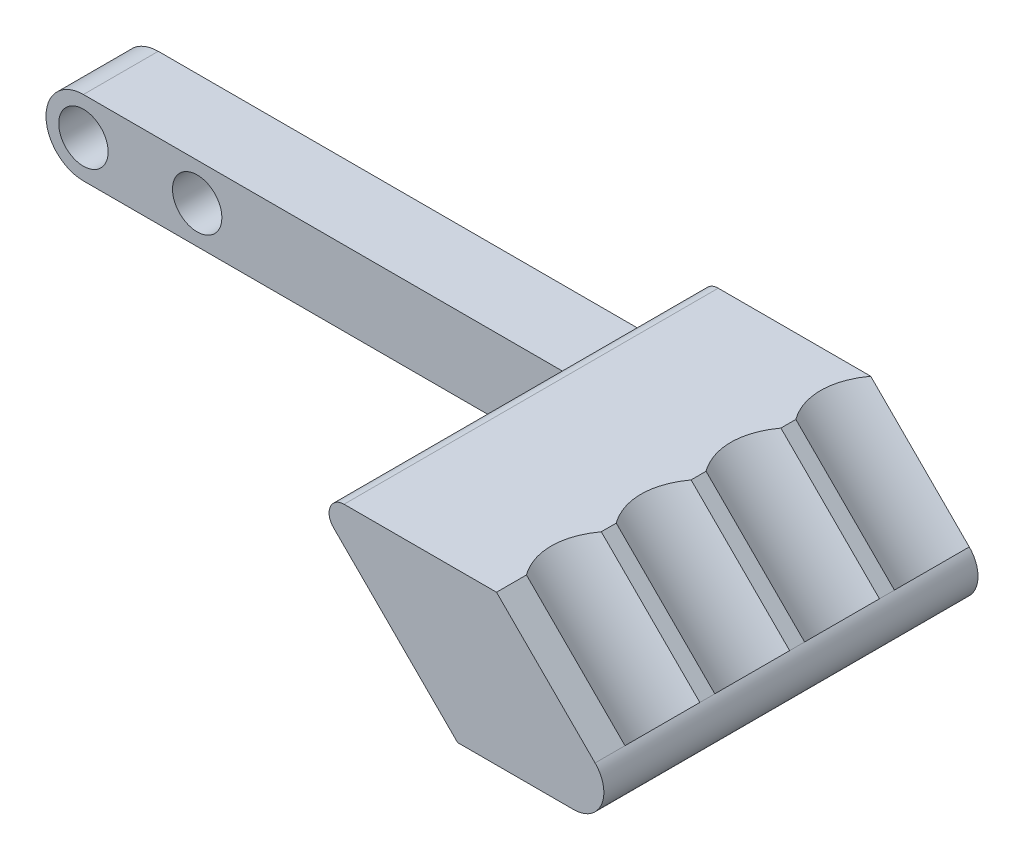
ISO-10303-21;
HEADER;
FILE_DESCRIPTION(('STEP AP214'),'2;1');
FILE_NAME('part.step','',(''),(''),'','','');
FILE_SCHEMA(('AUTOMOTIVE_DESIGN { 1 0 10303 214 1 1 1 1 }'));
ENDSEC;
DATA;
#1=APPLICATION_CONTEXT('core data for automotive mechanical design processes');
#2=APPLICATION_PROTOCOL_DEFINITION('international standard','automotive_design',2000,#1);
#3=PRODUCT_CONTEXT('',#1,'mechanical');
#4=PRODUCT('Part','Part','',(#3));
#5=PRODUCT_RELATED_PRODUCT_CATEGORY('part','',(#4));
#6=PRODUCT_DEFINITION_FORMATION('','',#4);
#7=PRODUCT_DEFINITION_CONTEXT('part definition',#1,'design');
#8=PRODUCT_DEFINITION('design','',#6,#7);
#9=PRODUCT_DEFINITION_SHAPE('','',#8);
#10=(LENGTH_UNIT() NAMED_UNIT(*) SI_UNIT(.MILLI.,.METRE.));
#11=(NAMED_UNIT(*) PLANE_ANGLE_UNIT() SI_UNIT($,.RADIAN.));
#12=(NAMED_UNIT(*) SI_UNIT($,.STERADIAN.) SOLID_ANGLE_UNIT());
#13=UNCERTAINTY_MEASURE_WITH_UNIT(LENGTH_MEASURE(1.E-05),#10,'distance_accuracy_value','');
#14=(GEOMETRIC_REPRESENTATION_CONTEXT(3) GLOBAL_UNCERTAINTY_ASSIGNED_CONTEXT((#13)) GLOBAL_UNIT_ASSIGNED_CONTEXT((#10,
#11,#12)) REPRESENTATION_CONTEXT('',''));
#15=CARTESIAN_POINT('',(0.,0.,0.));
#16=DIRECTION('',(0.,0.,1.));
#17=DIRECTION('',(1.,0.,0.));
#18=AXIS2_PLACEMENT_3D('',#15,#16,#17);
#19=CARTESIAN_POINT('',(54.1857864376269,0.91421356237309,25.));
#20=DIRECTION('',(-0.707106781186546,-0.707106781186549,0.));
#21=DIRECTION('',(0.707106781186549,-0.707106781186546,0.));
#22=AXIS2_PLACEMENT_3D('',#19,#20,#21);
#23=PLANE('',#22);
#24=DIRECTION('',(0.,0.,-1.));
#25=VECTOR('',#24,1.);
#26=CARTESIAN_POINT('',(47.6,7.5,25.));
#27=LINE('',#26,#25);
#28=CARTESIAN_POINT('',(47.6,7.5,6.00000000000006));
#29=VERTEX_POINT('',#28);
#30=CARTESIAN_POINT('',(47.6,7.5,4.99999999999994));
#31=VERTEX_POINT('',#30);
#32=EDGE_CURVE('E219',#29,#31,#27,.T.);
#33=ORIENTED_EDGE('',*,*,#32,.F.);
#34=DIRECTION('',(0.707106781186547,-0.707106781186548,0.));
#35=VECTOR('',#34,1.);
#36=CARTESIAN_POINT('',(30.1441558772842,24.9558441227156,6.00000000000024));
#37=LINE('',#36,#35);
#38=CARTESIAN_POINT('',(54.1857864376269,0.914213562373087,5.99999999999999));
#39=VERTEX_POINT('',#38);
#40=EDGE_CURVE('E11',#29,#39,#37,.T.);
#41=ORIENTED_EDGE('',*,*,#40,.T.);
#42=DIRECTION('',(0.,0.,-1.));
#43=VECTOR('',#42,1.);
#44=CARTESIAN_POINT('',(54.1857864376269,0.91421356237309,25.));
#45=LINE('',#44,#43);
#46=CARTESIAN_POINT('',(54.1857864376269,0.91421356237309,5.));
#47=VERTEX_POINT('',#46);
#48=EDGE_CURVE('E199',#39,#47,#45,.T.);
#49=ORIENTED_EDGE('',*,*,#48,.T.);
#50=DIRECTION('',(-0.707106781186549,0.707106781186546,0.));
#51=VECTOR('',#50,1.);
#52=CARTESIAN_POINT('',(27.5499999999999,27.55,5.));
#53=LINE('',#52,#51);
#54=EDGE_CURVE('E314',#47,#31,#53,.T.);
#55=ORIENTED_EDGE('',*,*,#54,.T.);
#56=EDGE_LOOP('',(#33,#41,#49,#55));
#57=FACE_BOUND('',#56,.T.);
#58=ADVANCED_FACE('F40',(#57),#23,.F.);
#59=CARTESIAN_POINT('',(54.1857864376268,0.914213562372999,12.0000000000002));
#60=VERTEX_POINT('',#59);
#61=CARTESIAN_POINT('',(54.1857864376269,0.91421356237309,11.));
#62=VERTEX_POINT('',#61);
#63=EDGE_CURVE('E216',#60,#62,#45,.T.);
#64=ORIENTED_EDGE('',*,*,#63,.T.);
#65=DIRECTION('',(0.707106781186547,-0.707106781186548,0.));
#66=VECTOR('',#65,1.);
#67=CARTESIAN_POINT('',(30.1441558772842,24.9558441227156,10.9999999999998));
#68=LINE('',#67,#66);
#69=CARTESIAN_POINT('',(47.6,7.49999999999988,10.9999999999998));
#70=VERTEX_POINT('',#69);
#71=EDGE_CURVE('E49',#62,#70,#68,.F.);
#72=ORIENTED_EDGE('',*,*,#71,.T.);
#73=CARTESIAN_POINT('',(47.6,7.5,12.0000000000001));
#74=VERTEX_POINT('',#73);
#75=EDGE_CURVE('E224',#74,#70,#27,.T.);
#76=ORIENTED_EDGE('',*,*,#75,.F.);
#77=DIRECTION('',(0.707106781186547,-0.707106781186548,0.));
#78=VECTOR('',#77,1.);
#79=CARTESIAN_POINT('',(30.1441558772842,24.9558441227156,12.0000000000002));
#80=LINE('',#79,#78);
#81=EDGE_CURVE('E279',#74,#60,#80,.T.);
#82=ORIENTED_EDGE('',*,*,#81,.T.);
#83=EDGE_LOOP('',(#64,#72,#76,#82));
#84=FACE_BOUND('',#83,.T.);
#85=ADVANCED_FACE('F286',(#84),#23,.F.);
#86=CARTESIAN_POINT('',(54.1857864376268,0.914213562372999,18.0000000000002));
#87=VERTEX_POINT('',#86);
#88=CARTESIAN_POINT('',(54.1857864376268,0.914213562372999,16.9999999999998));
#89=VERTEX_POINT('',#88);
#90=EDGE_CURVE('E191',#87,#89,#45,.T.);
#91=ORIENTED_EDGE('',*,*,#90,.T.);
#92=DIRECTION('',(0.707106781186547,-0.707106781186548,0.));
#93=VECTOR('',#92,1.);
#94=CARTESIAN_POINT('',(30.1441558772842,24.9558441227156,16.9999999999998));
#95=LINE('',#94,#93);
#96=CARTESIAN_POINT('',(47.6,7.5,16.9999999999998));
#97=VERTEX_POINT('',#96);
#98=EDGE_CURVE('E280',#89,#97,#95,.F.);
#99=ORIENTED_EDGE('',*,*,#98,.T.);
#100=CARTESIAN_POINT('',(47.6,7.5,18.0000000000001));
#101=VERTEX_POINT('',#100);
#102=EDGE_CURVE('E218',#101,#97,#27,.T.);
#103=ORIENTED_EDGE('',*,*,#102,.F.);
#104=DIRECTION('',(0.707106781186547,-0.707106781186548,0.));
#105=VECTOR('',#104,1.);
#106=CARTESIAN_POINT('',(30.1441558772842,24.9558441227156,18.0000000000002));
#107=LINE('',#106,#105);
#108=EDGE_CURVE('E172',#101,#87,#107,.T.);
#109=ORIENTED_EDGE('',*,*,#108,.T.);
#110=EDGE_LOOP('',(#91,#99,#103,#109));
#111=FACE_BOUND('',#110,.T.);
#112=ADVANCED_FACE('F300',(#111),#23,.F.);
#113=CARTESIAN_POINT('',(0.,0.,5.));
#114=DIRECTION('',(0.,0.,-1.));
#115=DIRECTION('',(-1.,0.,0.));
#116=AXIS2_PLACEMENT_3D('',#113,#114,#115);
#117=CYLINDRICAL_SURFACE('',#116,2.5);
#118=CARTESIAN_POINT('',(0.,0.,0.));
#119=DIRECTION('',(0.,0.,1.));
#120=DIRECTION('',(1.,0.,0.));
#121=AXIS2_PLACEMENT_3D('',#118,#119,#120);
#122=CIRCLE('',#121,2.5);
#123=CARTESIAN_POINT('',(0.,2.5,0.));
#124=VERTEX_POINT('',#123);
#125=CARTESIAN_POINT('',(0.,-2.5,0.));
#126=VERTEX_POINT('',#125);
#127=EDGE_CURVE('E338',#124,#126,#122,.T.);
#128=ORIENTED_EDGE('',*,*,#127,.T.);
#129=DIRECTION('',(0.,0.,-1.));
#130=VECTOR('',#129,1.);
#131=CARTESIAN_POINT('',(0.,-2.5,5.));
#132=LINE('',#131,#130);
#133=CARTESIAN_POINT('',(0.,-2.5,5.));
#134=VERTEX_POINT('',#133);
#135=EDGE_CURVE('E363',#134,#126,#132,.T.);
#136=ORIENTED_EDGE('',*,*,#135,.F.);
#137=CARTESIAN_POINT('',(0.,0.,5.));
#138=DIRECTION('',(0.,0.,1.));
#139=DIRECTION('',(1.,0.,0.));
#140=AXIS2_PLACEMENT_3D('',#137,#138,#139);
#141=CIRCLE('',#140,2.5);
#142=CARTESIAN_POINT('',(0.,2.5,5.));
#143=VERTEX_POINT('',#142);
#144=EDGE_CURVE('E326',#143,#134,#141,.T.);
#145=ORIENTED_EDGE('',*,*,#144,.F.);
#146=DIRECTION('',(0.,0.,-1.));
#147=VECTOR('',#146,1.);
#148=CARTESIAN_POINT('',(0.,2.5,5.));
#149=LINE('',#148,#147);
#150=EDGE_CURVE('E333',#143,#124,#149,.T.);
#151=ORIENTED_EDGE('',*,*,#150,.T.);
#152=EDGE_LOOP('',(#128,#136,#145,#151));
#153=FACE_BOUND('',#152,.T.);
#154=ADVANCED_FACE('F466',(#153),#117,.T.);
#155=CARTESIAN_POINT('',(0.,-2.5,5.));
#156=DIRECTION('',(0.,1.,0.));
#157=DIRECTION('',(0.,0.,1.));
#158=AXIS2_PLACEMENT_3D('',#155,#156,#157);
#159=PLANE('',#158);
#160=DIRECTION('',(1.,0.,0.));
#161=VECTOR('',#160,1.);
#162=CARTESIAN_POINT('',(0.,-2.5,0.));
#163=LINE('',#162,#161);
#164=CARTESIAN_POINT('',(52.7715728752538,-2.5,0.));
#165=VERTEX_POINT('',#164);
#166=EDGE_CURVE('E341',#126,#165,#163,.T.);
#167=ORIENTED_EDGE('',*,*,#166,.T.);
#168=DIRECTION('',(0.,0.,-1.));
#169=VECTOR('',#168,1.);
#170=CARTESIAN_POINT('',(52.7715728752538,-2.5,5.));
#171=LINE('',#170,#169);
#172=CARTESIAN_POINT('',(52.7715728752538,-2.5,25.));
#173=VERTEX_POINT('',#172);
#174=EDGE_CURVE('E371',#165,#173,#171,.F.);
#175=ORIENTED_EDGE('',*,*,#174,.T.);
#176=DIRECTION('',(1.,0.,0.));
#177=VECTOR('',#176,1.);
#178=CARTESIAN_POINT('',(52.7715728752538,-2.5,25.));
#179=LINE('',#178,#177);
#180=CARTESIAN_POINT('',(45.0000000000001,-2.5,25.));
#181=VERTEX_POINT('',#180);
#182=EDGE_CURVE('E238',#181,#173,#179,.T.);
#183=ORIENTED_EDGE('',*,*,#182,.F.);
#184=DIRECTION('',(0.,0.,-1.));
#185=VECTOR('',#184,1.);
#186=CARTESIAN_POINT('',(45.0000000000001,-2.5,25.));
#187=LINE('',#186,#185);
#188=CARTESIAN_POINT('',(45.0000000000001,-2.5,5.));
#189=VERTEX_POINT('',#188);
#190=EDGE_CURVE('E227',#181,#189,#187,.T.);
#191=ORIENTED_EDGE('',*,*,#190,.T.);
#192=DIRECTION('',(1.,0.,0.));
#193=VECTOR('',#192,1.);
#194=CARTESIAN_POINT('',(0.,-2.5,5.));
#195=LINE('',#194,#193);
#196=EDGE_CURVE('E318',#134,#189,#195,.T.);
#197=ORIENTED_EDGE('',*,*,#196,.F.);
#198=ORIENTED_EDGE('',*,*,#135,.T.);
#199=EDGE_LOOP('',(#167,#175,#183,#191,#197,#198));
#200=FACE_BOUND('',#199,.T.);
#201=ADVANCED_FACE('F421',(#200),#159,.F.);
#202=CARTESIAN_POINT('',(0.,7.5,5.));
#203=DIRECTION('',(0.,1.,0.));
#204=DIRECTION('',(0.,0.,1.));
#205=AXIS2_PLACEMENT_3D('',#202,#203,#204);
#206=PLANE('',#205);
#207=CARTESIAN_POINT('',(54.5282032302755,7.5,8.5));
#208=DIRECTION('',(0.,1.,0.));
#209=DIRECTION('',(1.,0.,0.));
#210=AXIS2_PLACEMENT_3D('',#207,#208,#209);
#211=ELLIPSE('',#210,7.77817459305201,5.5);
#212=EDGE_CURVE('E266',#29,#70,#211,.T.);
#213=ORIENTED_EDGE('',*,*,#212,.F.);
#214=ORIENTED_EDGE('',*,*,#32,.T.);
#215=CARTESIAN_POINT('',(54.5282032302755,7.5,2.5));
#216=DIRECTION('',(0.,1.,0.));
#217=DIRECTION('',(1.,0.,0.));
#218=AXIS2_PLACEMENT_3D('',#215,#216,#217);
#219=ELLIPSE('',#218,7.77817459305201,5.5);
#220=CARTESIAN_POINT('',(47.6,7.5,0.));
#221=VERTEX_POINT('',#220);
#222=EDGE_CURVE('E204',#221,#31,#219,.T.);
#223=ORIENTED_EDGE('',*,*,#222,.F.);
#224=DIRECTION('',(1.,0.,0.));
#225=VECTOR('',#224,1.);
#226=CARTESIAN_POINT('',(0.,7.5,0.));
#227=LINE('',#226,#225);
#228=CARTESIAN_POINT('',(37.4142135623731,7.5,0.));
#229=VERTEX_POINT('',#228);
#230=EDGE_CURVE('E346',#229,#221,#227,.T.);
#231=ORIENTED_EDGE('',*,*,#230,.F.);
#232=DIRECTION('',(0.,0.,-1.));
#233=VECTOR('',#232,1.);
#234=CARTESIAN_POINT('',(37.4142135623731,7.5,5.));
#235=LINE('',#234,#233);
#236=CARTESIAN_POINT('',(37.4142135623731,7.5,25.));
#237=VERTEX_POINT('',#236);
#238=EDGE_CURVE('E249',#229,#237,#235,.F.);
#239=ORIENTED_EDGE('',*,*,#238,.T.);
#240=DIRECTION('',(-1.,0.,0.));
#241=VECTOR('',#240,1.);
#242=CARTESIAN_POINT('',(37.4142135623731,7.5,25.));
#243=LINE('',#242,#241);
#244=CARTESIAN_POINT('',(47.6,7.5,25.));
#245=VERTEX_POINT('',#244);
#246=EDGE_CURVE('E257',#245,#237,#243,.T.);
#247=ORIENTED_EDGE('',*,*,#246,.F.);
#248=CARTESIAN_POINT('',(47.6,7.5,22.9999999999998));
#249=VERTEX_POINT('',#248);
#250=EDGE_CURVE('E209',#245,#249,#27,.T.);
#251=ORIENTED_EDGE('',*,*,#250,.T.);
#252=CARTESIAN_POINT('',(54.5282032302755,7.5,20.5));
#253=DIRECTION('',(0.,1.,0.));
#254=DIRECTION('',(1.,0.,0.));
#255=AXIS2_PLACEMENT_3D('',#252,#253,#254);
#256=ELLIPSE('',#255,7.77817459305201,5.5);
#257=EDGE_CURVE('E166',#101,#249,#256,.T.);
#258=ORIENTED_EDGE('',*,*,#257,.F.);
#259=ORIENTED_EDGE('',*,*,#102,.T.);
#260=CARTESIAN_POINT('',(54.5282032302755,7.5,14.5));
#261=DIRECTION('',(0.,1.,0.));
#262=DIRECTION('',(1.,0.,0.));
#263=AXIS2_PLACEMENT_3D('',#260,#261,#262);
#264=ELLIPSE('',#263,7.77817459305201,5.5);
#265=EDGE_CURVE('E63',#74,#97,#264,.T.);
#266=ORIENTED_EDGE('',*,*,#265,.F.);
#267=ORIENTED_EDGE('',*,*,#75,.T.);
#268=EDGE_LOOP('',(#213,#214,#223,#231,#239,#247,#251,#258,#259,#266,#267));
#269=FACE_BOUND('',#268,.T.);
#270=ADVANCED_FACE('F312',(#269),#206,.T.);
#271=CARTESIAN_POINT('',(21.2499999999998,21.25,5.));
#272=DIRECTION('',(-0.707106781186544,-0.707106781186551,0.));
#273=DIRECTION('',(0.707106781186551,-0.707106781186544,0.));
#274=AXIS2_PLACEMENT_3D('',#271,#272,#273);
#275=PLANE('',#274);
#276=DIRECTION('',(0.,0.,-1.));
#277=VECTOR('',#276,1.);
#278=CARTESIAN_POINT('',(38.2928932188134,4.20710678118655,5.));
#279=LINE('',#278,#277);
#280=CARTESIAN_POINT('',(38.2928932188134,4.20710678118655,0.));
#281=VERTEX_POINT('',#280);
#282=CARTESIAN_POINT('',(38.2928932188134,4.20710678118655,5.));
#283=VERTEX_POINT('',#282);
#284=EDGE_CURVE('E377',#281,#283,#279,.F.);
#285=ORIENTED_EDGE('',*,*,#284,.T.);
#286=DIRECTION('',(0.707106781186553,-0.707106781186542,0.));
#287=VECTOR('',#286,1.);
#288=CARTESIAN_POINT('',(38.2928932188134,4.20710678118655,5.));
#289=LINE('',#288,#287);
#290=EDGE_CURVE('E173',#283,#189,#289,.T.);
#291=ORIENTED_EDGE('',*,*,#290,.T.);
#292=ORIENTED_EDGE('',*,*,#190,.F.);
#293=DIRECTION('',(0.707106781186553,-0.707106781186542,0.));
#294=VECTOR('',#293,1.);
#295=CARTESIAN_POINT('',(38.2928932188134,4.20710678118655,25.));
#296=LINE('',#295,#294);
#297=CARTESIAN_POINT('',(36.7071067811865,5.79289321881344,25.));
#298=VERTEX_POINT('',#297);
#299=EDGE_CURVE('E244',#298,#181,#296,.T.);
#300=ORIENTED_EDGE('',*,*,#299,.F.);
#301=DIRECTION('',(0.,0.,-1.));
#302=VECTOR('',#301,1.);
#303=CARTESIAN_POINT('',(36.7071067811865,5.79289321881345,5.));
#304=LINE('',#303,#302);
#305=CARTESIAN_POINT('',(36.7071067811865,5.79289321881344,0.));
#306=VERTEX_POINT('',#305);
#307=EDGE_CURVE('E386',#298,#306,#304,.T.);
#308=ORIENTED_EDGE('',*,*,#307,.T.);
#309=DIRECTION('',(-0.707106781186551,0.707106781186544,0.));
#310=VECTOR('',#309,1.);
#311=CARTESIAN_POINT('',(21.2499999999998,21.25,0.));
#312=LINE('',#311,#310);
#313=EDGE_CURVE('E350',#281,#306,#312,.T.);
#314=ORIENTED_EDGE('',*,*,#313,.F.);
#315=EDGE_LOOP('',(#285,#291,#292,#300,#308,#314));
#316=FACE_BOUND('',#315,.T.);
#317=ADVANCED_FACE('F401',(#316),#275,.T.);
#318=CARTESIAN_POINT('',(0.,2.5,5.));
#319=DIRECTION('',(0.,1.,0.));
#320=DIRECTION('',(0.,0.,1.));
#321=AXIS2_PLACEMENT_3D('',#318,#319,#320);
#322=PLANE('',#321);
#323=DIRECTION('',(1.,0.,0.));
#324=VECTOR('',#323,1.);
#325=CARTESIAN_POINT('',(0.,2.5,5.));
#326=LINE('',#325,#324);
#327=CARTESIAN_POINT('',(37.5857864376269,2.5,5.));
#328=VERTEX_POINT('',#327);
#329=EDGE_CURVE('E317',#143,#328,#326,.T.);
#330=ORIENTED_EDGE('',*,*,#329,.T.);
#331=DIRECTION('',(0.,0.,-1.));
#332=VECTOR('',#331,1.);
#333=CARTESIAN_POINT('',(37.5857864376269,2.5,0.));
#334=LINE('',#333,#332);
#335=CARTESIAN_POINT('',(37.5857864376269,2.5,0.));
#336=VERTEX_POINT('',#335);
#337=EDGE_CURVE('E374',#328,#336,#334,.T.);
#338=ORIENTED_EDGE('',*,*,#337,.T.);
#339=DIRECTION('',(1.,0.,0.));
#340=VECTOR('',#339,1.);
#341=CARTESIAN_POINT('',(0.,2.5,0.));
#342=LINE('',#341,#340);
#343=EDGE_CURVE('E353',#124,#336,#342,.T.);
#344=ORIENTED_EDGE('',*,*,#343,.F.);
#345=ORIENTED_EDGE('',*,*,#150,.F.);
#346=EDGE_LOOP('',(#330,#338,#344,#345));
#347=FACE_BOUND('',#346,.T.);
#348=ADVANCED_FACE('F413',(#347),#322,.T.);
#349=CARTESIAN_POINT('',(0.,0.,5.));
#350=DIRECTION('',(0.,0.,-1.));
#351=DIRECTION('',(-1.,0.,0.));
#352=AXIS2_PLACEMENT_3D('',#349,#350,#351);
#353=CYLINDRICAL_SURFACE('',#352,1.65);
#354=CARTESIAN_POINT('',(0.,0.,5.));
#355=DIRECTION('',(0.,0.,1.));
#356=DIRECTION('',(1.,0.,0.));
#357=AXIS2_PLACEMENT_3D('',#354,#355,#356);
#358=CIRCLE('',#357,1.65);
#359=CARTESIAN_POINT('',(1.65,0.,5.));
#360=VERTEX_POINT('',#359);
#361=EDGE_CURVE('E361',#360,#360,#358,.T.);
#362=ORIENTED_EDGE('',*,*,#361,.T.);
#363=EDGE_LOOP('',(#362));
#364=FACE_BOUND('',#363,.T.);
#365=CARTESIAN_POINT('',(0.,0.,0.));
#366=DIRECTION('',(0.,0.,1.));
#367=DIRECTION('',(1.,0.,0.));
#368=AXIS2_PLACEMENT_3D('',#365,#366,#367);
#369=CIRCLE('',#368,1.65);
#370=CARTESIAN_POINT('',(1.65,0.,0.));
#371=VERTEX_POINT('',#370);
#372=EDGE_CURVE('E334',#371,#371,#369,.T.);
#373=ORIENTED_EDGE('',*,*,#372,.F.);
#374=EDGE_LOOP('',(#373));
#375=FACE_BOUND('',#374,.T.);
#376=ADVANCED_FACE('F432',(#364,#375),#353,.F.);
#377=CARTESIAN_POINT('',(7.6,0.,5.));
#378=DIRECTION('',(0.,0.,-1.));
#379=DIRECTION('',(-1.,0.,0.));
#380=AXIS2_PLACEMENT_3D('',#377,#378,#379);
#381=CYLINDRICAL_SURFACE('',#380,1.65);
#382=CARTESIAN_POINT('',(7.6,0.,5.));
#383=DIRECTION('',(0.,0.,1.));
#384=DIRECTION('',(1.,0.,0.));
#385=AXIS2_PLACEMENT_3D('',#382,#383,#384);
#386=CIRCLE('',#385,1.65);
#387=CARTESIAN_POINT('',(9.25,0.,5.));
#388=VERTEX_POINT('',#387);
#389=EDGE_CURVE('E323',#388,#388,#386,.T.);
#390=ORIENTED_EDGE('',*,*,#389,.T.);
#391=EDGE_LOOP('',(#390));
#392=FACE_BOUND('',#391,.T.);
#393=CARTESIAN_POINT('',(7.6,0.,0.));
#394=DIRECTION('',(0.,0.,1.));
#395=DIRECTION('',(1.,0.,0.));
#396=AXIS2_PLACEMENT_3D('',#393,#394,#395);
#397=CIRCLE('',#396,1.65);
#398=CARTESIAN_POINT('',(9.25,0.,0.));
#399=VERTEX_POINT('',#398);
#400=EDGE_CURVE('E357',#399,#399,#397,.T.);
#401=ORIENTED_EDGE('',*,*,#400,.F.);
#402=EDGE_LOOP('',(#401));
#403=FACE_BOUND('',#402,.T.);
#404=ADVANCED_FACE('F436',(#392,#403),#381,.F.);
#405=CARTESIAN_POINT('',(0.,0.,5.));
#406=DIRECTION('',(0.,0.,1.));
#407=DIRECTION('',(1.,0.,0.));
#408=AXIS2_PLACEMENT_3D('',#405,#406,#407);
#409=PLANE('',#408);
#410=ORIENTED_EDGE('',*,*,#290,.F.);
#411=CARTESIAN_POINT('',(37.5857864376269,3.5,5.));
#412=DIRECTION('',(0.,0.,1.));
#413=DIRECTION('',(1.,0.,0.));
#414=AXIS2_PLACEMENT_3D('',#411,#412,#413);
#415=CIRCLE('',#414,1.);
#416=EDGE_CURVE('E383',#283,#328,#415,.F.);
#417=ORIENTED_EDGE('',*,*,#416,.T.);
#418=ORIENTED_EDGE('',*,*,#329,.F.);
#419=ORIENTED_EDGE('',*,*,#144,.T.);
#420=ORIENTED_EDGE('',*,*,#196,.T.);
#421=EDGE_LOOP('',(#410,#417,#418,#419,#420));
#422=FACE_BOUND('',#421,.T.);
#423=ORIENTED_EDGE('',*,*,#361,.F.);
#424=EDGE_LOOP('',(#423));
#425=FACE_BOUND('',#424,.T.);
#426=ORIENTED_EDGE('',*,*,#389,.F.);
#427=EDGE_LOOP('',(#426));
#428=FACE_BOUND('',#427,.T.);
#429=ADVANCED_FACE('F418',(#422,#425,#428),#409,.T.);
#430=CARTESIAN_POINT('',(0.,0.,0.));
#431=DIRECTION('',(0.,0.,1.));
#432=DIRECTION('',(1.,0.,0.));
#433=AXIS2_PLACEMENT_3D('',#430,#431,#432);
#434=PLANE('',#433);
#435=ORIENTED_EDGE('',*,*,#372,.T.);
#436=EDGE_LOOP('',(#435));
#437=FACE_BOUND('',#436,.T.);
#438=ORIENTED_EDGE('',*,*,#313,.T.);
#439=CARTESIAN_POINT('',(37.4142135623731,6.5,0.));
#440=DIRECTION('',(0.,0.,1.));
#441=DIRECTION('',(1.,0.,0.));
#442=AXIS2_PLACEMENT_3D('',#439,#440,#441);
#443=CIRCLE('',#442,1.);
#444=EDGE_CURVE('E389',#306,#229,#443,.F.);
#445=ORIENTED_EDGE('',*,*,#444,.T.);
#446=ORIENTED_EDGE('',*,*,#230,.T.);
#447=DIRECTION('',(-0.707106781186549,0.707106781186546,0.));
#448=VECTOR('',#447,1.);
#449=CARTESIAN_POINT('',(27.5499999999999,27.55,0.));
#450=LINE('',#449,#448);
#451=CARTESIAN_POINT('',(54.1857864376269,0.914213562373085,0.));
#452=VERTEX_POINT('',#451);
#453=EDGE_CURVE('E344',#452,#221,#450,.T.);
#454=ORIENTED_EDGE('',*,*,#453,.F.);
#455=CARTESIAN_POINT('',(52.7715728752538,-0.500000000000004,0.));
#456=DIRECTION('',(0.,0.,1.));
#457=DIRECTION('',(1.,0.,0.));
#458=AXIS2_PLACEMENT_3D('',#455,#456,#457);
#459=CIRCLE('',#458,2.);
#460=EDGE_CURVE('E369',#452,#165,#459,.F.);
#461=ORIENTED_EDGE('',*,*,#460,.T.);
#462=ORIENTED_EDGE('',*,*,#166,.F.);
#463=ORIENTED_EDGE('',*,*,#127,.F.);
#464=ORIENTED_EDGE('',*,*,#343,.T.);
#465=CARTESIAN_POINT('',(37.5857864376269,3.5,0.));
#466=DIRECTION('',(0.,0.,1.));
#467=DIRECTION('',(1.,0.,0.));
#468=AXIS2_PLACEMENT_3D('',#465,#466,#467);
#469=CIRCLE('',#468,1.);
#470=EDGE_CURVE('E381',#336,#281,#469,.T.);
#471=ORIENTED_EDGE('',*,*,#470,.T.);
#472=EDGE_LOOP('',(#438,#445,#446,#454,#461,#462,#463,#464,#471));
#473=FACE_BOUND('',#472,.T.);
#474=ORIENTED_EDGE('',*,*,#400,.T.);
#475=EDGE_LOOP('',(#474));
#476=FACE_BOUND('',#475,.T.);
#477=ADVANCED_FACE('F404',(#437,#473,#476),#434,.F.);
#478=CARTESIAN_POINT('',(52.7715728752538,-0.500000000000004,5.));
#479=DIRECTION('',(0.,0.,-1.));
#480=DIRECTION('',(-1.,0.,0.));
#481=AXIS2_PLACEMENT_3D('',#478,#479,#480);
#482=CYLINDRICAL_SURFACE('',#481,2.);
#483=DIRECTION('',(0.,0.,-1.));
#484=VECTOR('',#483,1.);
#485=CARTESIAN_POINT('',(54.1857864376269,0.91421356237309,5.));
#486=LINE('',#485,#484);
#487=EDGE_CURVE('E367',#47,#452,#486,.T.);
#488=ORIENTED_EDGE('',*,*,#487,.F.);
#489=ORIENTED_EDGE('',*,*,#48,.F.);
#490=EDGE_CURVE('E208',#62,#39,#45,.T.);
#491=ORIENTED_EDGE('',*,*,#490,.F.);
#492=ORIENTED_EDGE('',*,*,#63,.F.);
#493=EDGE_CURVE('E291',#89,#60,#45,.T.);
#494=ORIENTED_EDGE('',*,*,#493,.F.);
#495=ORIENTED_EDGE('',*,*,#90,.F.);
#496=CARTESIAN_POINT('',(54.1857864376268,0.914213562372999,22.9999999999998));
#497=VERTEX_POINT('',#496);
#498=EDGE_CURVE('E178',#497,#87,#45,.T.);
#499=ORIENTED_EDGE('',*,*,#498,.F.);
#500=CARTESIAN_POINT('',(54.1857864376269,0.91421356237309,25.));
#501=VERTEX_POINT('',#500);
#502=EDGE_CURVE('E188',#501,#497,#45,.T.);
#503=ORIENTED_EDGE('',*,*,#502,.F.);
#504=CARTESIAN_POINT('',(52.7715728752538,-0.500000000000004,25.));
#505=DIRECTION('',(0.,0.,1.));
#506=DIRECTION('',(1.,0.,0.));
#507=AXIS2_PLACEMENT_3D('',#504,#505,#506);
#508=CIRCLE('',#507,2.);
#509=EDGE_CURVE('E263',#173,#501,#508,.T.);
#510=ORIENTED_EDGE('',*,*,#509,.F.);
#511=ORIENTED_EDGE('',*,*,#174,.F.);
#512=ORIENTED_EDGE('',*,*,#460,.F.);
#513=EDGE_LOOP('',(#488,#489,#491,#492,#494,#495,#499,#503,#510,#511,#512));
#514=FACE_BOUND('',#513,.T.);
#515=ADVANCED_FACE('F186',(#514),#482,.T.);
#516=CARTESIAN_POINT('',(37.5857864376269,3.5,5.));
#517=DIRECTION('',(0.,0.,1.));
#518=DIRECTION('',(1.,0.,0.));
#519=AXIS2_PLACEMENT_3D('',#516,#517,#518);
#520=CYLINDRICAL_SURFACE('',#519,1.);
#521=ORIENTED_EDGE('',*,*,#416,.F.);
#522=ORIENTED_EDGE('',*,*,#284,.F.);
#523=ORIENTED_EDGE('',*,*,#470,.F.);
#524=ORIENTED_EDGE('',*,*,#337,.F.);
#525=EDGE_LOOP('',(#521,#522,#523,#524));
#526=FACE_BOUND('',#525,.T.);
#527=ADVANCED_FACE('F411',(#526),#520,.F.);
#528=CARTESIAN_POINT('',(37.4142135623731,6.5,5.));
#529=DIRECTION('',(0.,0.,-1.));
#530=DIRECTION('',(-1.,0.,0.));
#531=AXIS2_PLACEMENT_3D('',#528,#529,#530);
#532=CYLINDRICAL_SURFACE('',#531,1.);
#533=ORIENTED_EDGE('',*,*,#307,.F.);
#534=CARTESIAN_POINT('',(37.4142135623731,6.5,25.));
#535=DIRECTION('',(0.,0.,1.));
#536=DIRECTION('',(1.,0.,0.));
#537=AXIS2_PLACEMENT_3D('',#534,#535,#536);
#538=CIRCLE('',#537,1.);
#539=EDGE_CURVE('E253',#237,#298,#538,.T.);
#540=ORIENTED_EDGE('',*,*,#539,.F.);
#541=ORIENTED_EDGE('',*,*,#238,.F.);
#542=ORIENTED_EDGE('',*,*,#444,.F.);
#543=EDGE_LOOP('',(#533,#540,#541,#542));
#544=FACE_BOUND('',#543,.T.);
#545=ADVANCED_FACE('F42',(#544),#532,.T.);
#546=CARTESIAN_POINT('',(33.6082574924221,28.4199457378535,2.5));
#547=DIRECTION('',(0.707106781186547,-0.707106781186548,0.));
#548=DIRECTION('',(0.707106781186548,0.707106781186547,0.));
#549=AXIS2_PLACEMENT_3D('',#546,#547,#548);
#550=CYLINDRICAL_SURFACE('',#549,5.5);
#551=CARTESIAN_POINT('',(57.6498880527647,4.37831517751083,2.5));
#552=DIRECTION('',(0.707106781186547,-0.707106781186548,0.));
#553=DIRECTION('',(0.707106781186548,0.707106781186547,0.));
#554=AXIS2_PLACEMENT_3D('',#551,#552,#553);
#555=CIRCLE('',#554,5.5);
#556=EDGE_CURVE('E198',#47,#452,#555,.T.);
#557=ORIENTED_EDGE('',*,*,#556,.T.);
#558=ORIENTED_EDGE('',*,*,#453,.T.);
#559=ORIENTED_EDGE('',*,*,#222,.T.);
#560=ORIENTED_EDGE('',*,*,#54,.F.);
#561=EDGE_LOOP('',(#557,#558,#559,#560));
#562=FACE_BOUND('',#561,.T.);
#563=ADVANCED_FACE('F425',(#562),#550,.F.);
#564=CARTESIAN_POINT('',(57.6498880527647,4.37831517751083,2.5));
#565=DIRECTION('',(0.707106781186547,-0.707106781186548,0.));
#566=DIRECTION('',(0.707106781186548,0.707106781186547,0.));
#567=AXIS2_PLACEMENT_3D('',#564,#565,#566);
#568=PLANE('',#567);
#569=ORIENTED_EDGE('',*,*,#487,.T.);
#570=ORIENTED_EDGE('',*,*,#556,.F.);
#571=EDGE_LOOP('',(#569,#570));
#572=FACE_BOUND('',#571,.T.);
#573=ADVANCED_FACE('F459',(#572),#568,.F.);
#574=ORIENTED_EDGE('',*,*,#502,.T.);
#575=DIRECTION('',(0.707106781186547,-0.707106781186548,0.));
#576=VECTOR('',#575,1.);
#577=CARTESIAN_POINT('',(30.1441558772842,24.9558441227156,22.9999999999998));
#578=LINE('',#577,#576);
#579=EDGE_CURVE('E160',#497,#249,#578,.F.);
#580=ORIENTED_EDGE('',*,*,#579,.T.);
#581=ORIENTED_EDGE('',*,*,#250,.F.);
#582=DIRECTION('',(-0.707106781186549,0.707106781186546,0.));
#583=VECTOR('',#582,1.);
#584=CARTESIAN_POINT('',(54.1857864376269,0.91421356237309,25.));
#585=LINE('',#584,#583);
#586=EDGE_CURVE('E195',#501,#245,#585,.T.);
#587=ORIENTED_EDGE('',*,*,#586,.F.);
#588=EDGE_LOOP('',(#574,#580,#581,#587));
#589=FACE_BOUND('',#588,.T.);
#590=ADVANCED_FACE('F194',(#589),#23,.F.);
#591=CARTESIAN_POINT('',(52.7715728752538,-0.500000000000004,25.));
#592=DIRECTION('',(0.,0.,1.));
#593=DIRECTION('',(1.,0.,0.));
#594=AXIS2_PLACEMENT_3D('',#591,#592,#593);
#595=PLANE('',#594);
#596=ORIENTED_EDGE('',*,*,#509,.T.);
#597=ORIENTED_EDGE('',*,*,#586,.T.);
#598=ORIENTED_EDGE('',*,*,#246,.T.);
#599=ORIENTED_EDGE('',*,*,#539,.T.);
#600=ORIENTED_EDGE('',*,*,#299,.T.);
#601=ORIENTED_EDGE('',*,*,#182,.T.);
#602=EDGE_LOOP('',(#596,#597,#598,#599,#600,#601));
#603=FACE_BOUND('',#602,.T.);
#604=ADVANCED_FACE('F397',(#603),#595,.T.);
#605=CARTESIAN_POINT('',(33.6082574924221,28.4199457378535,20.5));
#606=DIRECTION('',(0.707106781186547,-0.707106781186548,0.));
#607=DIRECTION('',(0.707106781186548,0.707106781186547,0.));
#608=AXIS2_PLACEMENT_3D('',#605,#606,#607);
#609=CYLINDRICAL_SURFACE('',#608,5.5);
#610=ORIENTED_EDGE('',*,*,#257,.T.);
#611=ORIENTED_EDGE('',*,*,#579,.F.);
#612=CARTESIAN_POINT('',(57.6498880527647,4.37831517751083,20.5));
#613=DIRECTION('',(0.707106781186547,-0.707106781186548,0.));
#614=DIRECTION('',(0.707106781186548,0.707106781186547,0.));
#615=AXIS2_PLACEMENT_3D('',#612,#613,#614);
#616=CIRCLE('',#615,5.5);
#617=EDGE_CURVE('E163',#497,#87,#616,.T.);
#618=ORIENTED_EDGE('',*,*,#617,.T.);
#619=ORIENTED_EDGE('',*,*,#108,.F.);
#620=EDGE_LOOP('',(#610,#611,#618,#619));
#621=FACE_BOUND('',#620,.T.);
#622=ADVANCED_FACE('F162',(#621),#609,.F.);
#623=CARTESIAN_POINT('',(57.6498880527647,4.37831517751083,8.5));
#624=DIRECTION('',(0.707106781186547,-0.707106781186548,0.));
#625=DIRECTION('',(0.707106781186548,0.707106781186547,0.));
#626=AXIS2_PLACEMENT_3D('',#623,#624,#625);
#627=PLANE('',#626);
#628=ORIENTED_EDGE('',*,*,#617,.F.);
#629=ORIENTED_EDGE('',*,*,#498,.T.);
#630=EDGE_LOOP('',(#628,#629));
#631=FACE_BOUND('',#630,.T.);
#632=ADVANCED_FACE('F177',(#631),#627,.F.);
#633=CARTESIAN_POINT('',(33.6082574924221,28.4199457378535,14.5));
#634=DIRECTION('',(0.707106781186547,-0.707106781186548,0.));
#635=DIRECTION('',(0.707106781186548,0.707106781186547,0.));
#636=AXIS2_PLACEMENT_3D('',#633,#634,#635);
#637=CYLINDRICAL_SURFACE('',#636,5.5);
#638=ORIENTED_EDGE('',*,*,#265,.T.);
#639=ORIENTED_EDGE('',*,*,#98,.F.);
#640=CARTESIAN_POINT('',(57.6498880527647,4.37831517751083,14.5));
#641=DIRECTION('',(0.707106781186547,-0.707106781186548,0.));
#642=DIRECTION('',(0.707106781186548,0.707106781186547,0.));
#643=AXIS2_PLACEMENT_3D('',#640,#641,#642);
#644=CIRCLE('',#643,5.5);
#645=EDGE_CURVE('E180',#89,#60,#644,.T.);
#646=ORIENTED_EDGE('',*,*,#645,.T.);
#647=ORIENTED_EDGE('',*,*,#81,.F.);
#648=EDGE_LOOP('',(#638,#639,#646,#647));
#649=FACE_BOUND('',#648,.T.);
#650=ADVANCED_FACE('F278',(#649),#637,.F.);
#651=ORIENTED_EDGE('',*,*,#645,.F.);
#652=ORIENTED_EDGE('',*,*,#493,.T.);
#653=EDGE_LOOP('',(#651,#652));
#654=FACE_BOUND('',#653,.T.);
#655=ADVANCED_FACE('F518',(#654),#627,.F.);
#656=CARTESIAN_POINT('',(33.6082574924221,28.4199457378535,8.5));
#657=DIRECTION('',(0.707106781186547,-0.707106781186548,0.));
#658=DIRECTION('',(0.707106781186548,0.707106781186547,0.));
#659=AXIS2_PLACEMENT_3D('',#656,#657,#658);
#660=CYLINDRICAL_SURFACE('',#659,5.5);
#661=ORIENTED_EDGE('',*,*,#212,.T.);
#662=ORIENTED_EDGE('',*,*,#71,.F.);
#663=CARTESIAN_POINT('',(57.6498880527647,4.37831517751083,8.5));
#664=DIRECTION('',(0.707106781186547,-0.707106781186548,0.));
#665=DIRECTION('',(0.707106781186548,0.707106781186547,0.));
#666=AXIS2_PLACEMENT_3D('',#663,#664,#665);
#667=CIRCLE('',#666,5.5);
#668=EDGE_CURVE('E55',#62,#39,#667,.T.);
#669=ORIENTED_EDGE('',*,*,#668,.T.);
#670=ORIENTED_EDGE('',*,*,#40,.F.);
#671=EDGE_LOOP('',(#661,#662,#669,#670));
#672=FACE_BOUND('',#671,.T.);
#673=ADVANCED_FACE('F532',(#672),#660,.F.);
#674=ORIENTED_EDGE('',*,*,#668,.F.);
#675=ORIENTED_EDGE('',*,*,#490,.T.);
#676=EDGE_LOOP('',(#674,#675));
#677=FACE_BOUND('',#676,.T.);
#678=ADVANCED_FACE('F517',(#677),#627,.F.);
#679=CLOSED_SHELL('',(#58,#85,#112,#154,#201,#270,#317,#348,#376,#404,#429,#477,#515,#527,#545,
#563,#573,#590,#604,#622,#632,#650,#655,#673,#678));
#680=MANIFOLD_SOLID_BREP('B2',#679);
#681=ADVANCED_BREP_SHAPE_REPRESENTATION('',(#18,#680),#14);
#682=SHAPE_DEFINITION_REPRESENTATION(#9,#681);
ENDSEC;
END-ISO-10303-21;
